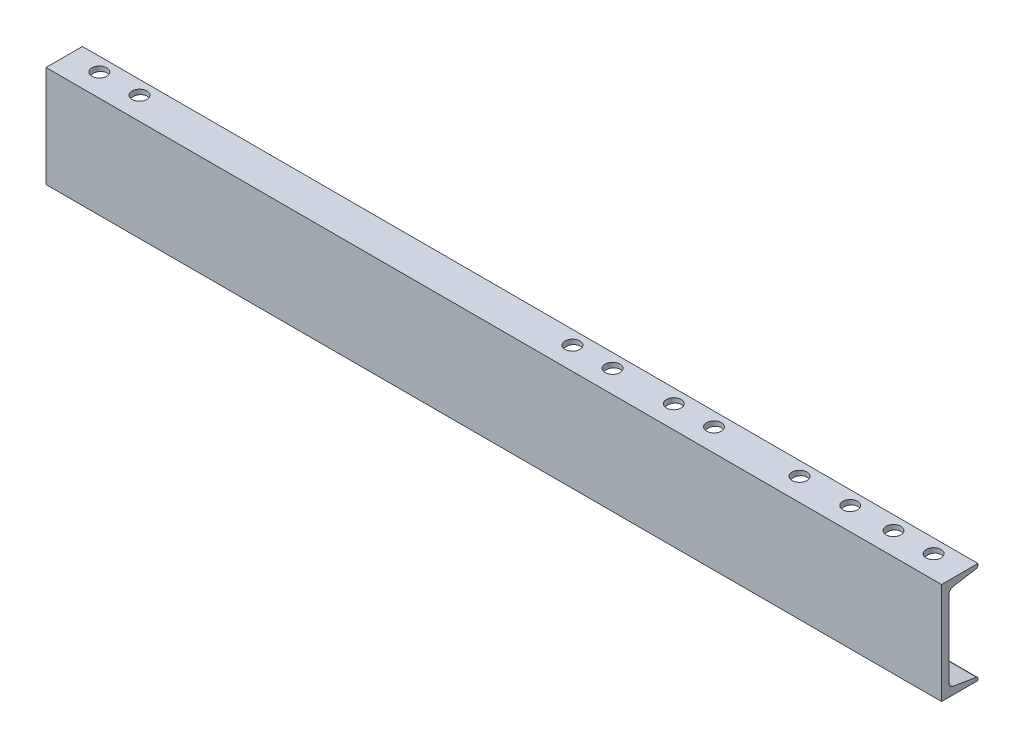
ISO-10303-21;
HEADER;
FILE_DESCRIPTION(('STEP AP214'),'2;1');
FILE_NAME('part.step','',(''),(''),'','','');
FILE_SCHEMA(('AUTOMOTIVE_DESIGN { 1 0 10303 214 1 1 1 1 }'));
ENDSEC;
DATA;
#1=APPLICATION_CONTEXT('core data for automotive mechanical design processes');
#2=APPLICATION_PROTOCOL_DEFINITION('international standard','automotive_design',2000,#1);
#3=PRODUCT_CONTEXT('',#1,'mechanical');
#4=PRODUCT('Part','Part','',(#3));
#5=PRODUCT_RELATED_PRODUCT_CATEGORY('part','',(#4));
#6=PRODUCT_DEFINITION_FORMATION('','',#4);
#7=PRODUCT_DEFINITION_CONTEXT('part definition',#1,'design');
#8=PRODUCT_DEFINITION('design','',#6,#7);
#9=PRODUCT_DEFINITION_SHAPE('','',#8);
#10=(LENGTH_UNIT() NAMED_UNIT(*) SI_UNIT(.MILLI.,.METRE.));
#11=(NAMED_UNIT(*) PLANE_ANGLE_UNIT() SI_UNIT($,.RADIAN.));
#12=(NAMED_UNIT(*) SI_UNIT($,.STERADIAN.) SOLID_ANGLE_UNIT());
#13=UNCERTAINTY_MEASURE_WITH_UNIT(LENGTH_MEASURE(1.E-05),#10,'distance_accuracy_value','');
#14=(GEOMETRIC_REPRESENTATION_CONTEXT(3) GLOBAL_UNCERTAINTY_ASSIGNED_CONTEXT((#13)) GLOBAL_UNIT_ASSIGNED_CONTEXT((#10,
#11,#12)) REPRESENTATION_CONTEXT('',''));
#15=CARTESIAN_POINT('',(0.,0.,0.));
#16=DIRECTION('',(0.,0.,1.));
#17=DIRECTION('',(1.,0.,0.));
#18=AXIS2_PLACEMENT_3D('',#15,#16,#17);
#19=CARTESIAN_POINT('',(673.1,-76.2,27.3939));
#20=DIRECTION('',(0.,1.,0.));
#21=DIRECTION('',(0.,0.,1.));
#22=AXIS2_PLACEMENT_3D('',#19,#20,#21);
#23=PLANE('',#22);
#24=CARTESIAN_POINT('',(425.45,-76.2,-6.73735));
#25=DIRECTION('',(0.,-1.,0.));
#26=DIRECTION('',(0.,0.,-1.));
#27=AXIS2_PLACEMENT_3D('',#24,#25,#26);
#28=CIRCLE('',#27,11.1125);
#29=CARTESIAN_POINT('',(425.45,-76.2,-17.84985));
#30=VERTEX_POINT('',#29);
#31=EDGE_CURVE('E250',#30,#30,#28,.T.);
#32=ORIENTED_EDGE('',*,*,#31,.F.);
#33=EDGE_LOOP('',(#32));
#34=FACE_BOUND('',#33,.T.);
#35=CARTESIAN_POINT('',(501.65,-76.2,-6.73735));
#36=DIRECTION('',(0.,-1.,0.));
#37=DIRECTION('',(0.,0.,-1.));
#38=AXIS2_PLACEMENT_3D('',#35,#36,#37);
#39=CIRCLE('',#38,11.1125);
#40=CARTESIAN_POINT('',(501.65,-76.2,-17.84985));
#41=VERTEX_POINT('',#40);
#42=EDGE_CURVE('E254',#41,#41,#39,.T.);
#43=ORIENTED_EDGE('',*,*,#42,.F.);
#44=EDGE_LOOP('',(#43));
#45=FACE_BOUND('',#44,.T.);
#46=CARTESIAN_POINT('',(-627.0625,-76.2,-6.73735));
#47=DIRECTION('',(0.,-1.,0.));
#48=DIRECTION('',(0.,0.,-1.));
#49=AXIS2_PLACEMENT_3D('',#46,#47,#48);
#50=CIRCLE('',#49,11.1125);
#51=CARTESIAN_POINT('',(-627.0625,-76.2,-17.84985));
#52=VERTEX_POINT('',#51);
#53=EDGE_CURVE('E258',#52,#52,#50,.T.);
#54=ORIENTED_EDGE('',*,*,#53,.F.);
#55=EDGE_LOOP('',(#54));
#56=FACE_BOUND('',#55,.T.);
#57=CARTESIAN_POINT('',(-566.7375,-76.2,-6.73735));
#58=DIRECTION('',(0.,-1.,0.));
#59=DIRECTION('',(0.,0.,-1.));
#60=AXIS2_PLACEMENT_3D('',#57,#58,#59);
#61=CIRCLE('',#60,11.1125);
#62=CARTESIAN_POINT('',(-566.7375,-76.2,-17.84985));
#63=VERTEX_POINT('',#62);
#64=EDGE_CURVE('E262',#63,#63,#61,.T.);
#65=ORIENTED_EDGE('',*,*,#64,.F.);
#66=EDGE_LOOP('',(#65));
#67=FACE_BOUND('',#66,.T.);
#68=CARTESIAN_POINT('',(84.1375,-76.2,-6.73735));
#69=DIRECTION('',(0.,-1.,0.));
#70=DIRECTION('',(0.,0.,-1.));
#71=AXIS2_PLACEMENT_3D('',#68,#69,#70);
#72=CIRCLE('',#71,11.1125);
#73=CARTESIAN_POINT('',(84.1375,-76.2,-17.84985));
#74=VERTEX_POINT('',#73);
#75=EDGE_CURVE('E266',#74,#74,#72,.T.);
#76=ORIENTED_EDGE('',*,*,#75,.F.);
#77=EDGE_LOOP('',(#76));
#78=FACE_BOUND('',#77,.T.);
#79=CARTESIAN_POINT('',(236.5375,-76.2,-6.73735));
#80=DIRECTION('',(0.,-1.,0.));
#81=DIRECTION('',(0.,0.,-1.));
#82=AXIS2_PLACEMENT_3D('',#79,#80,#81);
#83=CIRCLE('',#82,11.1125);
#84=CARTESIAN_POINT('',(236.5375,-76.2,-17.84985));
#85=VERTEX_POINT('',#84);
#86=EDGE_CURVE('E270',#85,#85,#83,.T.);
#87=ORIENTED_EDGE('',*,*,#86,.F.);
#88=EDGE_LOOP('',(#87));
#89=FACE_BOUND('',#88,.T.);
#90=CARTESIAN_POINT('',(296.8625,-76.2,-6.73735));
#91=DIRECTION('',(0.,-1.,0.));
#92=DIRECTION('',(0.,0.,-1.));
#93=AXIS2_PLACEMENT_3D('',#90,#91,#92);
#94=CIRCLE('',#93,11.1125);
#95=CARTESIAN_POINT('',(296.8625,-76.2,-17.84985));
#96=VERTEX_POINT('',#95);
#97=EDGE_CURVE('E274',#96,#96,#94,.T.);
#98=ORIENTED_EDGE('',*,*,#97,.F.);
#99=EDGE_LOOP('',(#98));
#100=FACE_BOUND('',#99,.T.);
#101=CARTESIAN_POINT('',(144.4625,-76.2,-6.73735));
#102=DIRECTION('',(0.,-1.,0.));
#103=DIRECTION('',(0.,0.,-1.));
#104=AXIS2_PLACEMENT_3D('',#101,#102,#103);
#105=CIRCLE('',#104,11.1125);
#106=CARTESIAN_POINT('',(144.4625,-76.2,-17.84985));
#107=VERTEX_POINT('',#106);
#108=EDGE_CURVE('E278',#107,#107,#105,.T.);
#109=ORIENTED_EDGE('',*,*,#108,.F.);
#110=EDGE_LOOP('',(#109));
#111=FACE_BOUND('',#110,.T.);
#112=CARTESIAN_POINT('',(566.7375,-76.2,-6.73735));
#113=DIRECTION('',(0.,-1.,0.));
#114=DIRECTION('',(0.,0.,-1.));
#115=AXIS2_PLACEMENT_3D('',#112,#113,#114);
#116=CIRCLE('',#115,11.1125);
#117=CARTESIAN_POINT('',(566.7375,-76.2,-17.84985));
#118=VERTEX_POINT('',#117);
#119=EDGE_CURVE('E282',#118,#118,#116,.T.);
#120=ORIENTED_EDGE('',*,*,#119,.F.);
#121=EDGE_LOOP('',(#120));
#122=FACE_BOUND('',#121,.T.);
#123=CARTESIAN_POINT('',(627.0625,-76.2,-6.73735));
#124=DIRECTION('',(0.,-1.,0.));
#125=DIRECTION('',(0.,0.,-1.));
#126=AXIS2_PLACEMENT_3D('',#123,#124,#125);
#127=CIRCLE('',#126,11.1125);
#128=CARTESIAN_POINT('',(627.0625,-76.2,-17.84985));
#129=VERTEX_POINT('',#128);
#130=EDGE_CURVE('E285',#129,#129,#127,.T.);
#131=ORIENTED_EDGE('',*,*,#130,.F.);
#132=EDGE_LOOP('',(#131));
#133=FACE_BOUND('',#132,.T.);
#134=DIRECTION('',(0.,0.,-1.));
#135=VECTOR('',#134,1.);
#136=CARTESIAN_POINT('',(-673.1,-76.2,27.3939));
#137=LINE('',#136,#135);
#138=CARTESIAN_POINT('',(-673.1,-76.2,27.3939));
#139=VERTEX_POINT('',#138);
#140=CARTESIAN_POINT('',(-673.1,-76.2,-27.3939));
#141=VERTEX_POINT('',#140);
#142=EDGE_CURVE('E137',#139,#141,#137,.T.);
#143=ORIENTED_EDGE('',*,*,#142,.T.);
#144=DIRECTION('',(-1.,0.,0.));
#145=VECTOR('',#144,1.);
#146=CARTESIAN_POINT('',(673.1,-76.2,-27.3939));
#147=LINE('',#146,#145);
#148=CARTESIAN_POINT('',(673.1,-76.2,-27.3939));
#149=VERTEX_POINT('',#148);
#150=EDGE_CURVE('E11',#149,#141,#147,.T.);
#151=ORIENTED_EDGE('',*,*,#150,.F.);
#152=DIRECTION('',(0.,0.,-1.));
#153=VECTOR('',#152,1.);
#154=CARTESIAN_POINT('',(673.1,-76.2,27.3939));
#155=LINE('',#154,#153);
#156=CARTESIAN_POINT('',(673.1,-76.2,27.3939));
#157=VERTEX_POINT('',#156);
#158=EDGE_CURVE('E160',#157,#149,#155,.T.);
#159=ORIENTED_EDGE('',*,*,#158,.F.);
#160=DIRECTION('',(-1.,0.,0.));
#161=VECTOR('',#160,1.);
#162=CARTESIAN_POINT('',(673.1,-76.2,27.3939));
#163=LINE('',#162,#161);
#164=EDGE_CURVE('E133',#157,#139,#163,.T.);
#165=ORIENTED_EDGE('',*,*,#164,.T.);
#166=EDGE_LOOP('',(#143,#151,#159,#165));
#167=FACE_BOUND('',#166,.T.);
#168=ADVANCED_FACE('F17',(#34,#45,#56,#67,#78,#89,#100,#111,#122,#133,#167),#23,.F.);
#169=CARTESIAN_POINT('',(673.1,-76.2,-27.3939));
#170=DIRECTION('',(0.,0.,1.));
#171=DIRECTION('',(1.,0.,0.));
#172=AXIS2_PLACEMENT_3D('',#169,#170,#171);
#173=PLANE('',#172);
#174=DIRECTION('',(0.,1.,0.));
#175=VECTOR('',#174,1.);
#176=CARTESIAN_POINT('',(-673.1,-76.2,-27.3939));
#177=LINE('',#176,#175);
#178=CARTESIAN_POINT('',(-673.1,-73.7107446530364,-27.3939));
#179=VERTEX_POINT('',#178);
#180=EDGE_CURVE('E140',#141,#179,#177,.T.);
#181=ORIENTED_EDGE('',*,*,#180,.T.);
#182=DIRECTION('',(-1.,0.,0.));
#183=VECTOR('',#182,1.);
#184=CARTESIAN_POINT('',(673.1,-73.7107446530364,-27.3939));
#185=LINE('',#184,#183);
#186=CARTESIAN_POINT('',(673.1,-73.7107446530364,-27.3939));
#187=VERTEX_POINT('',#186);
#188=EDGE_CURVE('E25',#187,#179,#185,.T.);
#189=ORIENTED_EDGE('',*,*,#188,.F.);
#190=DIRECTION('',(0.,1.,0.));
#191=VECTOR('',#190,1.);
#192=CARTESIAN_POINT('',(673.1,-76.2,-27.3939));
#193=LINE('',#192,#191);
#194=EDGE_CURVE('E88',#149,#187,#193,.T.);
#195=ORIENTED_EDGE('',*,*,#194,.F.);
#196=ORIENTED_EDGE('',*,*,#150,.T.);
#197=EDGE_LOOP('',(#181,#189,#195,#196));
#198=FACE_BOUND('',#197,.T.);
#199=ADVANCED_FACE('F241',(#198),#173,.F.);
#200=CARTESIAN_POINT('',(673.1,-73.7107446530364,-24.3459));
#201=DIRECTION('',(-1.,0.,0.));
#202=DIRECTION('',(0.,0.,1.));
#203=AXIS2_PLACEMENT_3D('',#200,#201,#202);
#204=CYLINDRICAL_SURFACE('',#203,3.048);
#205=CARTESIAN_POINT('',(-673.1,-73.7107446530364,-24.3459));
#206=DIRECTION('',(1.,0.,0.));
#207=DIRECTION('',(0.,0.,-1.));
#208=AXIS2_PLACEMENT_3D('',#205,#206,#207);
#209=CIRCLE('',#208,3.048);
#210=CARTESIAN_POINT('',(-673.1,-70.7042219011292,-24.8470236796088));
#211=VERTEX_POINT('',#210);
#212=EDGE_CURVE('E143',#179,#211,#209,.T.);
#213=ORIENTED_EDGE('',*,*,#212,.T.);
#214=DIRECTION('',(-1.,0.,0.));
#215=VECTOR('',#214,1.);
#216=CARTESIAN_POINT('',(673.1,-70.7042219011292,-24.8470236796088));
#217=LINE('',#216,#215);
#218=CARTESIAN_POINT('',(673.1,-70.7042219011292,-24.8470236796088));
#219=VERTEX_POINT('',#218);
#220=EDGE_CURVE('E179',#219,#211,#217,.T.);
#221=ORIENTED_EDGE('',*,*,#220,.F.);
#222=CARTESIAN_POINT('',(673.1,-73.7107446530364,-24.3459));
#223=DIRECTION('',(1.,0.,0.));
#224=DIRECTION('',(0.,0.,-1.));
#225=AXIS2_PLACEMENT_3D('',#222,#223,#224);
#226=CIRCLE('',#225,3.048);
#227=EDGE_CURVE('E187',#187,#219,#226,.T.);
#228=ORIENTED_EDGE('',*,*,#227,.F.);
#229=ORIENTED_EDGE('',*,*,#188,.T.);
#230=EDGE_LOOP('',(#213,#221,#228,#229));
#231=FACE_BOUND('',#230,.T.);
#232=ADVANCED_FACE('F185',(#231),#204,.T.);
#233=CARTESIAN_POINT('',(673.1,-64.908143628462,9.92690919902199));
#234=DIRECTION('',(0.,-0.986391978972162,0.164410656039631));
#235=DIRECTION('',(0.,-0.164410656039631,-0.986391978972162));
#236=AXIS2_PLACEMENT_3D('',#233,#234,#235);
#237=PLANE('',#236);
#238=CARTESIAN_POINT('',(425.45,-67.6857227711681,-6.73735));
#239=DIRECTION('',(0.,-0.986391978972162,0.164410656039631));
#240=DIRECTION('',(0.,-0.164410656039631,-0.986391978972162));
#241=AXIS2_PLACEMENT_3D('',#238,#239,#240);
#242=ELLIPSE('',#241,11.2658053156306,11.1125);
#243=CARTESIAN_POINT('',(425.45,-69.5379412139257,-17.84985));
#244=VERTEX_POINT('',#243);
#245=EDGE_CURVE('E516',#244,#244,#242,.T.);
#246=ORIENTED_EDGE('',*,*,#245,.T.);
#247=EDGE_LOOP('',(#246));
#248=FACE_BOUND('',#247,.T.);
#249=CARTESIAN_POINT('',(501.65,-67.6857227711681,-6.73735));
#250=DIRECTION('',(0.,-0.986391978972162,0.164410656039631));
#251=DIRECTION('',(0.,-0.164410656039631,-0.986391978972162));
#252=AXIS2_PLACEMENT_3D('',#249,#250,#251);
#253=ELLIPSE('',#252,11.2658053156306,11.1125);
#254=CARTESIAN_POINT('',(501.65,-69.5379412139257,-17.8498499999999));
#255=VERTEX_POINT('',#254);
#256=EDGE_CURVE('E532',#255,#255,#253,.T.);
#257=ORIENTED_EDGE('',*,*,#256,.T.);
#258=EDGE_LOOP('',(#257));
#259=FACE_BOUND('',#258,.T.);
#260=CARTESIAN_POINT('',(-627.0625,-67.6857227711681,-6.73735));
#261=DIRECTION('',(0.,-0.986391978972162,0.164410656039631));
#262=DIRECTION('',(0.,-0.164410656039631,-0.986391978972162));
#263=AXIS2_PLACEMENT_3D('',#260,#261,#262);
#264=ELLIPSE('',#263,11.2658053156306,11.1125);
#265=CARTESIAN_POINT('',(-627.0625,-69.5379412139257,-17.8498499999999));
#266=VERTEX_POINT('',#265);
#267=EDGE_CURVE('E542',#266,#266,#264,.T.);
#268=ORIENTED_EDGE('',*,*,#267,.T.);
#269=EDGE_LOOP('',(#268));
#270=FACE_BOUND('',#269,.T.);
#271=CARTESIAN_POINT('',(-566.7375,-67.6857227711681,-6.73735));
#272=DIRECTION('',(0.,-0.986391978972162,0.164410656039631));
#273=DIRECTION('',(0.,-0.164410656039631,-0.986391978972162));
#274=AXIS2_PLACEMENT_3D('',#271,#272,#273);
#275=ELLIPSE('',#274,11.2658053156306,11.1125);
#276=CARTESIAN_POINT('',(-566.7375,-69.5379412139257,-17.8498499999999));
#277=VERTEX_POINT('',#276);
#278=EDGE_CURVE('E552',#277,#277,#275,.T.);
#279=ORIENTED_EDGE('',*,*,#278,.T.);
#280=EDGE_LOOP('',(#279));
#281=FACE_BOUND('',#280,.T.);
#282=CARTESIAN_POINT('',(84.1375,-67.6857227711681,-6.73735));
#283=DIRECTION('',(0.,-0.986391978972162,0.164410656039631));
#284=DIRECTION('',(0.,-0.164410656039631,-0.986391978972162));
#285=AXIS2_PLACEMENT_3D('',#282,#283,#284);
#286=ELLIPSE('',#285,11.2658053156306,11.1125);
#287=CARTESIAN_POINT('',(84.1375,-69.5379412139257,-17.8498499999999));
#288=VERTEX_POINT('',#287);
#289=EDGE_CURVE('E562',#288,#288,#286,.T.);
#290=ORIENTED_EDGE('',*,*,#289,.T.);
#291=EDGE_LOOP('',(#290));
#292=FACE_BOUND('',#291,.T.);
#293=CARTESIAN_POINT('',(236.5375,-67.6857227711681,-6.73735));
#294=DIRECTION('',(0.,-0.986391978972162,0.164410656039631));
#295=DIRECTION('',(0.,-0.164410656039631,-0.986391978972162));
#296=AXIS2_PLACEMENT_3D('',#293,#294,#295);
#297=ELLIPSE('',#296,11.2658053156306,11.1125);
#298=CARTESIAN_POINT('',(236.5375,-69.5379412139257,-17.8498499999999));
#299=VERTEX_POINT('',#298);
#300=EDGE_CURVE('E572',#299,#299,#297,.T.);
#301=ORIENTED_EDGE('',*,*,#300,.T.);
#302=EDGE_LOOP('',(#301));
#303=FACE_BOUND('',#302,.T.);
#304=CARTESIAN_POINT('',(296.8625,-67.6857227711681,-6.73735));
#305=DIRECTION('',(0.,-0.986391978972162,0.164410656039631));
#306=DIRECTION('',(0.,-0.164410656039631,-0.986391978972162));
#307=AXIS2_PLACEMENT_3D('',#304,#305,#306);
#308=ELLIPSE('',#307,11.2658053156306,11.1125);
#309=CARTESIAN_POINT('',(296.8625,-69.5379412139257,-17.8498499999999));
#310=VERTEX_POINT('',#309);
#311=EDGE_CURVE('E582',#310,#310,#308,.T.);
#312=ORIENTED_EDGE('',*,*,#311,.T.);
#313=EDGE_LOOP('',(#312));
#314=FACE_BOUND('',#313,.T.);
#315=CARTESIAN_POINT('',(144.4625,-67.6857227711681,-6.73735));
#316=DIRECTION('',(0.,-0.986391978972162,0.164410656039631));
#317=DIRECTION('',(0.,-0.164410656039631,-0.986391978972162));
#318=AXIS2_PLACEMENT_3D('',#315,#316,#317);
#319=ELLIPSE('',#318,11.2658053156306,11.1125);
#320=CARTESIAN_POINT('',(144.4625,-69.5379412139257,-17.8498499999999));
#321=VERTEX_POINT('',#320);
#322=EDGE_CURVE('E592',#321,#321,#319,.T.);
#323=ORIENTED_EDGE('',*,*,#322,.T.);
#324=EDGE_LOOP('',(#323));
#325=FACE_BOUND('',#324,.T.);
#326=CARTESIAN_POINT('',(566.7375,-67.6857227711681,-6.73735));
#327=DIRECTION('',(0.,-0.986391978972162,0.164410656039631));
#328=DIRECTION('',(0.,-0.164410656039631,-0.986391978972162));
#329=AXIS2_PLACEMENT_3D('',#326,#327,#328);
#330=ELLIPSE('',#329,11.2658053156306,11.1125);
#331=CARTESIAN_POINT('',(566.7375,-69.5379412139257,-17.8498499999999));
#332=VERTEX_POINT('',#331);
#333=EDGE_CURVE('E288',#332,#332,#330,.T.);
#334=ORIENTED_EDGE('',*,*,#333,.T.);
#335=EDGE_LOOP('',(#334));
#336=FACE_BOUND('',#335,.T.);
#337=CARTESIAN_POINT('',(627.0625,-67.6857227711681,-6.73735));
#338=DIRECTION('',(0.,-0.986391978972162,0.164410656039631));
#339=DIRECTION('',(0.,-0.164410656039631,-0.986391978972162));
#340=AXIS2_PLACEMENT_3D('',#337,#338,#339);
#341=ELLIPSE('',#340,11.2658053156306,11.1125);
#342=CARTESIAN_POINT('',(627.0625,-69.5379412139257,-17.8498499999999));
#343=VERTEX_POINT('',#342);
#344=EDGE_CURVE('E141',#343,#343,#341,.T.);
#345=ORIENTED_EDGE('',*,*,#344,.T.);
#346=EDGE_LOOP('',(#345));
#347=FACE_BOUND('',#346,.T.);
#348=DIRECTION('',(0.,0.164410656039631,0.986391978972162));
#349=VECTOR('',#348,1.);
#350=CARTESIAN_POINT('',(-673.1,-64.908143628462,9.92690919902199));
#351=LINE('',#350,#349);
#352=CARTESIAN_POINT('',(-673.1,-64.908143628462,9.92690919902199));
#353=VERTEX_POINT('',#352);
#354=EDGE_CURVE('E145',#211,#353,#351,.T.);
#355=ORIENTED_EDGE('',*,*,#354,.T.);
#356=DIRECTION('',(-1.,0.,0.));
#357=VECTOR('',#356,1.);
#358=CARTESIAN_POINT('',(673.1,-64.908143628462,9.92690919902199));
#359=LINE('',#358,#357);
#360=CARTESIAN_POINT('',(673.1,-64.908143628462,9.92690919902199));
#361=VERTEX_POINT('',#360);
#362=EDGE_CURVE('E176',#361,#353,#359,.T.);
#363=ORIENTED_EDGE('',*,*,#362,.F.);
#364=DIRECTION('',(0.,0.164410656039631,0.986391978972162));
#365=VECTOR('',#364,1.);
#366=CARTESIAN_POINT('',(673.1,-64.908143628462,9.92690919902199));
#367=LINE('',#366,#365);
#368=EDGE_CURVE('E205',#219,#361,#367,.T.);
#369=ORIENTED_EDGE('',*,*,#368,.F.);
#370=ORIENTED_EDGE('',*,*,#220,.T.);
#371=EDGE_LOOP('',(#355,#363,#369,#370));
#372=FACE_BOUND('',#371,.T.);
#373=ADVANCED_FACE('F196',(#248,#259,#270,#281,#292,#303,#314,#325,#336,#347,#372),#237,.F.);
#374=CARTESIAN_POINT('',(673.1,-57.3918367486941,8.6741));
#375=DIRECTION('',(-1.,0.,0.));
#376=DIRECTION('',(0.,0.,1.));
#377=AXIS2_PLACEMENT_3D('',#374,#375,#376);
#378=CYLINDRICAL_SURFACE('',#377,7.62);
#379=CARTESIAN_POINT('',(-673.1,-57.3918367486941,8.6741));
#380=DIRECTION('',(-1.,0.,0.));
#381=DIRECTION('',(0.,0.,-1.));
#382=AXIS2_PLACEMENT_3D('',#379,#380,#381);
#383=CIRCLE('',#382,7.62);
#384=CARTESIAN_POINT('',(-673.1,-57.3918367486941,16.2941));
#385=VERTEX_POINT('',#384);
#386=EDGE_CURVE('E147',#353,#385,#383,.T.);
#387=ORIENTED_EDGE('',*,*,#386,.T.);
#388=DIRECTION('',(-1.,0.,0.));
#389=VECTOR('',#388,1.);
#390=CARTESIAN_POINT('',(673.1,-57.3918367486941,16.2941));
#391=LINE('',#390,#389);
#392=CARTESIAN_POINT('',(673.1,-57.3918367486941,16.2941));
#393=VERTEX_POINT('',#392);
#394=EDGE_CURVE('E173',#393,#385,#391,.T.);
#395=ORIENTED_EDGE('',*,*,#394,.F.);
#396=CARTESIAN_POINT('',(673.1,-57.3918367486941,8.6741));
#397=DIRECTION('',(-1.,0.,0.));
#398=DIRECTION('',(0.,0.,-1.));
#399=AXIS2_PLACEMENT_3D('',#396,#397,#398);
#400=CIRCLE('',#399,7.62);
#401=EDGE_CURVE('E202',#361,#393,#400,.T.);
#402=ORIENTED_EDGE('',*,*,#401,.F.);
#403=ORIENTED_EDGE('',*,*,#362,.T.);
#404=EDGE_LOOP('',(#387,#395,#402,#403));
#405=FACE_BOUND('',#404,.T.);
#406=ADVANCED_FACE('F200',(#405),#378,.F.);
#407=CARTESIAN_POINT('',(673.1,57.3918367486941,16.2941));
#408=DIRECTION('',(0.,0.,1.));
#409=DIRECTION('',(0.,-1.,0.));
#410=AXIS2_PLACEMENT_3D('',#407,#408,#409);
#411=PLANE('',#410);
#412=DIRECTION('',(0.,1.,0.));
#413=VECTOR('',#412,1.);
#414=CARTESIAN_POINT('',(-673.1,57.3918367486941,16.2941));
#415=LINE('',#414,#413);
#416=CARTESIAN_POINT('',(-673.1,57.3918367486941,16.2941));
#417=VERTEX_POINT('',#416);
#418=EDGE_CURVE('E149',#385,#417,#415,.T.);
#419=ORIENTED_EDGE('',*,*,#418,.T.);
#420=DIRECTION('',(-1.,0.,0.));
#421=VECTOR('',#420,1.);
#422=CARTESIAN_POINT('',(673.1,57.3918367486941,16.2941));
#423=LINE('',#422,#421);
#424=CARTESIAN_POINT('',(673.1,57.3918367486941,16.2941));
#425=VERTEX_POINT('',#424);
#426=EDGE_CURVE('E170',#425,#417,#423,.T.);
#427=ORIENTED_EDGE('',*,*,#426,.F.);
#428=DIRECTION('',(0.,1.,0.));
#429=VECTOR('',#428,1.);
#430=CARTESIAN_POINT('',(673.1,57.3918367486941,16.2941));
#431=LINE('',#430,#429);
#432=EDGE_CURVE('E204',#393,#425,#431,.T.);
#433=ORIENTED_EDGE('',*,*,#432,.F.);
#434=ORIENTED_EDGE('',*,*,#394,.T.);
#435=EDGE_LOOP('',(#419,#427,#433,#434));
#436=FACE_BOUND('',#435,.T.);
#437=ADVANCED_FACE('F615',(#436),#411,.F.);
#438=CARTESIAN_POINT('',(673.1,57.3918367486941,8.6741));
#439=DIRECTION('',(-1.,0.,0.));
#440=DIRECTION('',(0.,0.,1.));
#441=AXIS2_PLACEMENT_3D('',#438,#439,#440);
#442=CYLINDRICAL_SURFACE('',#441,7.62);
#443=CARTESIAN_POINT('',(-673.1,57.3918367486941,8.6741));
#444=DIRECTION('',(-1.,0.,0.));
#445=DIRECTION('',(0.,0.,1.));
#446=AXIS2_PLACEMENT_3D('',#443,#444,#445);
#447=CIRCLE('',#446,7.62);
#448=CARTESIAN_POINT('',(-673.1,64.908143628462,9.92690919902198));
#449=VERTEX_POINT('',#448);
#450=EDGE_CURVE('E151',#417,#449,#447,.T.);
#451=ORIENTED_EDGE('',*,*,#450,.T.);
#452=DIRECTION('',(-1.,0.,0.));
#453=VECTOR('',#452,1.);
#454=CARTESIAN_POINT('',(673.1,64.908143628462,9.92690919902198));
#455=LINE('',#454,#453);
#456=CARTESIAN_POINT('',(673.1,64.908143628462,9.92690919902198));
#457=VERTEX_POINT('',#456);
#458=EDGE_CURVE('E167',#457,#449,#455,.T.);
#459=ORIENTED_EDGE('',*,*,#458,.F.);
#460=CARTESIAN_POINT('',(673.1,57.3918367486941,8.6741));
#461=DIRECTION('',(-1.,0.,0.));
#462=DIRECTION('',(0.,0.,1.));
#463=AXIS2_PLACEMENT_3D('',#460,#461,#462);
#464=CIRCLE('',#463,7.62);
#465=EDGE_CURVE('E207',#425,#457,#464,.T.);
#466=ORIENTED_EDGE('',*,*,#465,.F.);
#467=ORIENTED_EDGE('',*,*,#426,.T.);
#468=EDGE_LOOP('',(#451,#459,#466,#467));
#469=FACE_BOUND('',#468,.T.);
#470=ADVANCED_FACE('F604',(#469),#442,.F.);
#471=CARTESIAN_POINT('',(673.1,64.908143628462,9.92690919902198));
#472=DIRECTION('',(0.,0.986391978972162,0.16441065603963));
#473=DIRECTION('',(0.,-0.16441065603963,0.986391978972162));
#474=AXIS2_PLACEMENT_3D('',#471,#472,#473);
#475=PLANE('',#474);
#476=CARTESIAN_POINT('',(425.45,67.6857227711681,-6.73735));
#477=DIRECTION('',(0.,0.986391978972162,0.16441065603963));
#478=DIRECTION('',(0.,-0.16441065603963,0.986391978972162));
#479=AXIS2_PLACEMENT_3D('',#476,#477,#478);
#480=ELLIPSE('',#479,11.2658053156306,11.1125);
#481=CARTESIAN_POINT('',(425.45,65.8335043284105,4.37515000000001));
#482=VERTEX_POINT('',#481);
#483=EDGE_CURVE('E518',#482,#482,#480,.T.);
#484=ORIENTED_EDGE('',*,*,#483,.T.);
#485=EDGE_LOOP('',(#484));
#486=FACE_BOUND('',#485,.T.);
#487=CARTESIAN_POINT('',(501.65,67.6857227711681,-6.73735));
#488=DIRECTION('',(0.,0.986391978972162,0.16441065603963));
#489=DIRECTION('',(0.,-0.16441065603963,0.986391978972162));
#490=AXIS2_PLACEMENT_3D('',#487,#488,#489);
#491=ELLIPSE('',#490,11.2658053156306,11.1125);
#492=CARTESIAN_POINT('',(501.65,65.8335043284105,4.37514999999995));
#493=VERTEX_POINT('',#492);
#494=EDGE_CURVE('E529',#493,#493,#491,.T.);
#495=ORIENTED_EDGE('',*,*,#494,.T.);
#496=EDGE_LOOP('',(#495));
#497=FACE_BOUND('',#496,.T.);
#498=CARTESIAN_POINT('',(-627.0625,67.6857227711681,-6.73735));
#499=DIRECTION('',(0.,0.986391978972162,0.16441065603963));
#500=DIRECTION('',(0.,-0.16441065603963,0.986391978972162));
#501=AXIS2_PLACEMENT_3D('',#498,#499,#500);
#502=ELLIPSE('',#501,11.2658053156306,11.1125);
#503=CARTESIAN_POINT('',(-627.0625,65.8335043284105,4.37514999999995));
#504=VERTEX_POINT('',#503);
#505=EDGE_CURVE('E539',#504,#504,#502,.T.);
#506=ORIENTED_EDGE('',*,*,#505,.T.);
#507=EDGE_LOOP('',(#506));
#508=FACE_BOUND('',#507,.T.);
#509=CARTESIAN_POINT('',(-566.7375,67.6857227711681,-6.73735));
#510=DIRECTION('',(0.,0.986391978972162,0.16441065603963));
#511=DIRECTION('',(0.,-0.16441065603963,0.986391978972162));
#512=AXIS2_PLACEMENT_3D('',#509,#510,#511);
#513=ELLIPSE('',#512,11.2658053156306,11.1125);
#514=CARTESIAN_POINT('',(-566.7375,65.8335043284105,4.37514999999995));
#515=VERTEX_POINT('',#514);
#516=EDGE_CURVE('E549',#515,#515,#513,.T.);
#517=ORIENTED_EDGE('',*,*,#516,.T.);
#518=EDGE_LOOP('',(#517));
#519=FACE_BOUND('',#518,.T.);
#520=CARTESIAN_POINT('',(84.1375,67.6857227711681,-6.73735));
#521=DIRECTION('',(0.,0.986391978972162,0.16441065603963));
#522=DIRECTION('',(0.,-0.16441065603963,0.986391978972162));
#523=AXIS2_PLACEMENT_3D('',#520,#521,#522);
#524=ELLIPSE('',#523,11.2658053156306,11.1125);
#525=CARTESIAN_POINT('',(84.1375,65.8335043284105,4.37514999999995));
#526=VERTEX_POINT('',#525);
#527=EDGE_CURVE('E559',#526,#526,#524,.T.);
#528=ORIENTED_EDGE('',*,*,#527,.T.);
#529=EDGE_LOOP('',(#528));
#530=FACE_BOUND('',#529,.T.);
#531=CARTESIAN_POINT('',(236.5375,67.6857227711681,-6.73735));
#532=DIRECTION('',(0.,0.986391978972162,0.16441065603963));
#533=DIRECTION('',(0.,-0.16441065603963,0.986391978972162));
#534=AXIS2_PLACEMENT_3D('',#531,#532,#533);
#535=ELLIPSE('',#534,11.2658053156306,11.1125);
#536=CARTESIAN_POINT('',(236.5375,65.8335043284105,4.37514999999995));
#537=VERTEX_POINT('',#536);
#538=EDGE_CURVE('E569',#537,#537,#535,.T.);
#539=ORIENTED_EDGE('',*,*,#538,.T.);
#540=EDGE_LOOP('',(#539));
#541=FACE_BOUND('',#540,.T.);
#542=CARTESIAN_POINT('',(296.8625,67.6857227711681,-6.73735));
#543=DIRECTION('',(0.,0.986391978972162,0.16441065603963));
#544=DIRECTION('',(0.,-0.16441065603963,0.986391978972162));
#545=AXIS2_PLACEMENT_3D('',#542,#543,#544);
#546=ELLIPSE('',#545,11.2658053156306,11.1125);
#547=CARTESIAN_POINT('',(296.8625,65.8335043284105,4.37514999999995));
#548=VERTEX_POINT('',#547);
#549=EDGE_CURVE('E579',#548,#548,#546,.T.);
#550=ORIENTED_EDGE('',*,*,#549,.T.);
#551=EDGE_LOOP('',(#550));
#552=FACE_BOUND('',#551,.T.);
#553=CARTESIAN_POINT('',(144.4625,67.6857227711681,-6.73735));
#554=DIRECTION('',(0.,0.986391978972162,0.16441065603963));
#555=DIRECTION('',(0.,-0.16441065603963,0.986391978972162));
#556=AXIS2_PLACEMENT_3D('',#553,#554,#555);
#557=ELLIPSE('',#556,11.2658053156306,11.1125);
#558=CARTESIAN_POINT('',(144.4625,65.8335043284105,4.37514999999995));
#559=VERTEX_POINT('',#558);
#560=EDGE_CURVE('E589',#559,#559,#557,.T.);
#561=ORIENTED_EDGE('',*,*,#560,.T.);
#562=EDGE_LOOP('',(#561));
#563=FACE_BOUND('',#562,.T.);
#564=CARTESIAN_POINT('',(566.7375,67.6857227711681,-6.73735));
#565=DIRECTION('',(0.,0.986391978972162,0.16441065603963));
#566=DIRECTION('',(0.,-0.16441065603963,0.986391978972162));
#567=AXIS2_PLACEMENT_3D('',#564,#565,#566);
#568=ELLIPSE('',#567,11.2658053156306,11.1125);
#569=CARTESIAN_POINT('',(566.7375,65.8335043284105,4.37514999999995));
#570=VERTEX_POINT('',#569);
#571=EDGE_CURVE('E294',#570,#570,#568,.T.);
#572=ORIENTED_EDGE('',*,*,#571,.T.);
#573=EDGE_LOOP('',(#572));
#574=FACE_BOUND('',#573,.T.);
#575=CARTESIAN_POINT('',(627.0625,67.6857227711681,-6.73735));
#576=DIRECTION('',(0.,0.986391978972162,0.16441065603963));
#577=DIRECTION('',(0.,-0.16441065603963,0.986391978972162));
#578=AXIS2_PLACEMENT_3D('',#575,#576,#577);
#579=ELLIPSE('',#578,11.2658053156306,11.1125);
#580=CARTESIAN_POINT('',(627.0625,65.8335043284105,4.37514999999995));
#581=VERTEX_POINT('',#580);
#582=EDGE_CURVE('E291',#581,#581,#579,.T.);
#583=ORIENTED_EDGE('',*,*,#582,.T.);
#584=EDGE_LOOP('',(#583));
#585=FACE_BOUND('',#584,.T.);
#586=DIRECTION('',(0.,0.16441065603963,-0.986391978972162));
#587=VECTOR('',#586,1.);
#588=CARTESIAN_POINT('',(-673.1,64.908143628462,9.92690919902198));
#589=LINE('',#588,#587);
#590=CARTESIAN_POINT('',(-673.1,70.7042219011292,-24.8470236796088));
#591=VERTEX_POINT('',#590);
#592=EDGE_CURVE('E153',#449,#591,#589,.T.);
#593=ORIENTED_EDGE('',*,*,#592,.T.);
#594=DIRECTION('',(-1.,0.,0.));
#595=VECTOR('',#594,1.);
#596=CARTESIAN_POINT('',(673.1,70.7042219011292,-24.8470236796088));
#597=LINE('',#596,#595);
#598=CARTESIAN_POINT('',(673.1,70.7042219011292,-24.8470236796088));
#599=VERTEX_POINT('',#598);
#600=EDGE_CURVE('E164',#599,#591,#597,.T.);
#601=ORIENTED_EDGE('',*,*,#600,.F.);
#602=DIRECTION('',(0.,0.16441065603963,-0.986391978972162));
#603=VECTOR('',#602,1.);
#604=CARTESIAN_POINT('',(673.1,64.908143628462,9.92690919902198));
#605=LINE('',#604,#603);
#606=EDGE_CURVE('E213',#457,#599,#605,.T.);
#607=ORIENTED_EDGE('',*,*,#606,.F.);
#608=ORIENTED_EDGE('',*,*,#458,.T.);
#609=EDGE_LOOP('',(#593,#601,#607,#608));
#610=FACE_BOUND('',#609,.T.);
#611=ADVANCED_FACE('F219',(#486,#497,#508,#519,#530,#541,#552,#563,#574,#585,#610),#475,.F.);
#612=CARTESIAN_POINT('',(673.1,73.7107446530364,-24.3459));
#613=DIRECTION('',(-1.,0.,0.));
#614=DIRECTION('',(0.,0.,1.));
#615=AXIS2_PLACEMENT_3D('',#612,#613,#614);
#616=CYLINDRICAL_SURFACE('',#615,3.048);
#617=CARTESIAN_POINT('',(-673.1,73.7107446530364,-24.3459));
#618=DIRECTION('',(1.,0.,0.));
#619=DIRECTION('',(0.,0.,1.));
#620=AXIS2_PLACEMENT_3D('',#617,#618,#619);
#621=CIRCLE('',#620,3.048);
#622=CARTESIAN_POINT('',(-673.1,73.7107446530364,-27.3939));
#623=VERTEX_POINT('',#622);
#624=EDGE_CURVE('E155',#591,#623,#621,.T.);
#625=ORIENTED_EDGE('',*,*,#624,.T.);
#626=DIRECTION('',(-1.,0.,0.));
#627=VECTOR('',#626,1.);
#628=CARTESIAN_POINT('',(673.1,73.7107446530364,-27.3939));
#629=LINE('',#628,#627);
#630=CARTESIAN_POINT('',(673.1,73.7107446530364,-27.3939));
#631=VERTEX_POINT('',#630);
#632=EDGE_CURVE('E128',#631,#623,#629,.T.);
#633=ORIENTED_EDGE('',*,*,#632,.F.);
#634=CARTESIAN_POINT('',(673.1,73.7107446530364,-24.3459));
#635=DIRECTION('',(1.,0.,0.));
#636=DIRECTION('',(0.,0.,1.));
#637=AXIS2_PLACEMENT_3D('',#634,#635,#636);
#638=CIRCLE('',#637,3.048);
#639=EDGE_CURVE('E119',#599,#631,#638,.T.);
#640=ORIENTED_EDGE('',*,*,#639,.F.);
#641=ORIENTED_EDGE('',*,*,#600,.T.);
#642=EDGE_LOOP('',(#625,#633,#640,#641));
#643=FACE_BOUND('',#642,.T.);
#644=ADVANCED_FACE('F223',(#643),#616,.T.);
#645=CARTESIAN_POINT('',(673.1,76.2,-27.3939));
#646=DIRECTION('',(0.,0.,1.));
#647=DIRECTION('',(0.,-1.,0.));
#648=AXIS2_PLACEMENT_3D('',#645,#646,#647);
#649=PLANE('',#648);
#650=DIRECTION('',(0.,1.,0.));
#651=VECTOR('',#650,1.);
#652=CARTESIAN_POINT('',(-673.1,76.2,-27.3939));
#653=LINE('',#652,#651);
#654=CARTESIAN_POINT('',(-673.1,76.2,-27.3939));
#655=VERTEX_POINT('',#654);
#656=EDGE_CURVE('E127',#623,#655,#653,.T.);
#657=ORIENTED_EDGE('',*,*,#656,.T.);
#658=DIRECTION('',(-1.,0.,0.));
#659=VECTOR('',#658,1.);
#660=CARTESIAN_POINT('',(673.1,76.2,-27.3939));
#661=LINE('',#660,#659);
#662=CARTESIAN_POINT('',(673.1,76.2,-27.3939));
#663=VERTEX_POINT('',#662);
#664=EDGE_CURVE('E124',#663,#655,#661,.T.);
#665=ORIENTED_EDGE('',*,*,#664,.F.);
#666=DIRECTION('',(0.,1.,0.));
#667=VECTOR('',#666,1.);
#668=CARTESIAN_POINT('',(673.1,76.2,-27.3939));
#669=LINE('',#668,#667);
#670=EDGE_CURVE('E113',#631,#663,#669,.T.);
#671=ORIENTED_EDGE('',*,*,#670,.F.);
#672=ORIENTED_EDGE('',*,*,#632,.T.);
#673=EDGE_LOOP('',(#657,#665,#671,#672));
#674=FACE_BOUND('',#673,.T.);
#675=ADVANCED_FACE('F125',(#674),#649,.F.);
#676=CARTESIAN_POINT('',(673.1,76.2,27.3939));
#677=DIRECTION('',(0.,-1.,0.));
#678=DIRECTION('',(0.,0.,-1.));
#679=AXIS2_PLACEMENT_3D('',#676,#677,#678);
#680=PLANE('',#679);
#681=CARTESIAN_POINT('',(425.45,76.2,-6.73735));
#682=DIRECTION('',(0.,-1.,0.));
#683=DIRECTION('',(0.,0.,-1.));
#684=AXIS2_PLACEMENT_3D('',#681,#682,#683);
#685=CIRCLE('',#684,11.1125);
#686=CARTESIAN_POINT('',(425.45,76.2,-17.84985));
#687=VERTEX_POINT('',#686);
#688=EDGE_CURVE('E523',#687,#687,#685,.F.);
#689=ORIENTED_EDGE('',*,*,#688,.F.);
#690=EDGE_LOOP('',(#689));
#691=FACE_BOUND('',#690,.T.);
#692=CARTESIAN_POINT('',(501.65,76.2,-6.73735));
#693=DIRECTION('',(0.,-1.,0.));
#694=DIRECTION('',(0.,0.,-1.));
#695=AXIS2_PLACEMENT_3D('',#692,#693,#694);
#696=CIRCLE('',#695,11.1125);
#697=CARTESIAN_POINT('',(501.65,76.2,-17.84985));
#698=VERTEX_POINT('',#697);
#699=EDGE_CURVE('E520',#698,#698,#696,.F.);
#700=ORIENTED_EDGE('',*,*,#699,.F.);
#701=EDGE_LOOP('',(#700));
#702=FACE_BOUND('',#701,.T.);
#703=CARTESIAN_POINT('',(-627.0625,76.2,-6.73735));
#704=DIRECTION('',(0.,-1.,0.));
#705=DIRECTION('',(0.,0.,-1.));
#706=AXIS2_PLACEMENT_3D('',#703,#704,#705);
#707=CIRCLE('',#706,11.1125);
#708=CARTESIAN_POINT('',(-627.0625,76.2,-17.84985));
#709=VERTEX_POINT('',#708);
#710=EDGE_CURVE('E536',#709,#709,#707,.F.);
#711=ORIENTED_EDGE('',*,*,#710,.F.);
#712=EDGE_LOOP('',(#711));
#713=FACE_BOUND('',#712,.T.);
#714=CARTESIAN_POINT('',(-566.7375,76.2,-6.73735));
#715=DIRECTION('',(0.,-1.,0.));
#716=DIRECTION('',(0.,0.,-1.));
#717=AXIS2_PLACEMENT_3D('',#714,#715,#716);
#718=CIRCLE('',#717,11.1125);
#719=CARTESIAN_POINT('',(-566.7375,76.2,-17.84985));
#720=VERTEX_POINT('',#719);
#721=EDGE_CURVE('E546',#720,#720,#718,.F.);
#722=ORIENTED_EDGE('',*,*,#721,.F.);
#723=EDGE_LOOP('',(#722));
#724=FACE_BOUND('',#723,.T.);
#725=CARTESIAN_POINT('',(84.1375,76.2,-6.73735));
#726=DIRECTION('',(0.,-1.,0.));
#727=DIRECTION('',(0.,0.,-1.));
#728=AXIS2_PLACEMENT_3D('',#725,#726,#727);
#729=CIRCLE('',#728,11.1125);
#730=CARTESIAN_POINT('',(84.1375,76.2,-17.84985));
#731=VERTEX_POINT('',#730);
#732=EDGE_CURVE('E556',#731,#731,#729,.F.);
#733=ORIENTED_EDGE('',*,*,#732,.F.);
#734=EDGE_LOOP('',(#733));
#735=FACE_BOUND('',#734,.T.);
#736=CARTESIAN_POINT('',(236.5375,76.2,-6.73735));
#737=DIRECTION('',(0.,-1.,0.));
#738=DIRECTION('',(0.,0.,-1.));
#739=AXIS2_PLACEMENT_3D('',#736,#737,#738);
#740=CIRCLE('',#739,11.1125);
#741=CARTESIAN_POINT('',(236.5375,76.2,-17.84985));
#742=VERTEX_POINT('',#741);
#743=EDGE_CURVE('E566',#742,#742,#740,.F.);
#744=ORIENTED_EDGE('',*,*,#743,.F.);
#745=EDGE_LOOP('',(#744));
#746=FACE_BOUND('',#745,.T.);
#747=CARTESIAN_POINT('',(296.8625,76.2,-6.73735));
#748=DIRECTION('',(0.,-1.,0.));
#749=DIRECTION('',(0.,0.,-1.));
#750=AXIS2_PLACEMENT_3D('',#747,#748,#749);
#751=CIRCLE('',#750,11.1125);
#752=CARTESIAN_POINT('',(296.8625,76.2,-17.84985));
#753=VERTEX_POINT('',#752);
#754=EDGE_CURVE('E576',#753,#753,#751,.F.);
#755=ORIENTED_EDGE('',*,*,#754,.F.);
#756=EDGE_LOOP('',(#755));
#757=FACE_BOUND('',#756,.T.);
#758=CARTESIAN_POINT('',(144.4625,76.2,-6.73735));
#759=DIRECTION('',(0.,-1.,0.));
#760=DIRECTION('',(0.,0.,-1.));
#761=AXIS2_PLACEMENT_3D('',#758,#759,#760);
#762=CIRCLE('',#761,11.1125);
#763=CARTESIAN_POINT('',(144.4625,76.2,-17.84985));
#764=VERTEX_POINT('',#763);
#765=EDGE_CURVE('E586',#764,#764,#762,.F.);
#766=ORIENTED_EDGE('',*,*,#765,.F.);
#767=EDGE_LOOP('',(#766));
#768=FACE_BOUND('',#767,.T.);
#769=CARTESIAN_POINT('',(566.7375,76.2,-6.73735));
#770=DIRECTION('',(0.,-1.,0.));
#771=DIRECTION('',(0.,0.,-1.));
#772=AXIS2_PLACEMENT_3D('',#769,#770,#771);
#773=CIRCLE('',#772,11.1125);
#774=CARTESIAN_POINT('',(566.7375,76.2,-17.84985));
#775=VERTEX_POINT('',#774);
#776=EDGE_CURVE('E596',#775,#775,#773,.F.);
#777=ORIENTED_EDGE('',*,*,#776,.F.);
#778=EDGE_LOOP('',(#777));
#779=FACE_BOUND('',#778,.T.);
#780=CARTESIAN_POINT('',(627.0625,76.2,-6.73735));
#781=DIRECTION('',(0.,-1.,0.));
#782=DIRECTION('',(0.,0.,-1.));
#783=AXIS2_PLACEMENT_3D('',#780,#781,#782);
#784=CIRCLE('',#783,11.1125);
#785=CARTESIAN_POINT('',(627.0625,76.2,-17.84985));
#786=VERTEX_POINT('',#785);
#787=EDGE_CURVE('E287',#786,#786,#784,.F.);
#788=ORIENTED_EDGE('',*,*,#787,.F.);
#789=EDGE_LOOP('',(#788));
#790=FACE_BOUND('',#789,.T.);
#791=DIRECTION('',(0.,0.,1.));
#792=VECTOR('',#791,1.);
#793=CARTESIAN_POINT('',(-673.1,76.2,27.3939));
#794=LINE('',#793,#792);
#795=CARTESIAN_POINT('',(-673.1,76.2,27.3939));
#796=VERTEX_POINT('',#795);
#797=EDGE_CURVE('E74',#655,#796,#794,.T.);
#798=ORIENTED_EDGE('',*,*,#797,.T.);
#799=DIRECTION('',(-1.,0.,0.));
#800=VECTOR('',#799,1.);
#801=CARTESIAN_POINT('',(673.1,76.2,27.3939));
#802=LINE('',#801,#800);
#803=CARTESIAN_POINT('',(673.1,76.2,27.3939));
#804=VERTEX_POINT('',#803);
#805=EDGE_CURVE('E129',#804,#796,#802,.T.);
#806=ORIENTED_EDGE('',*,*,#805,.F.);
#807=DIRECTION('',(0.,0.,1.));
#808=VECTOR('',#807,1.);
#809=CARTESIAN_POINT('',(673.1,76.2,27.3939));
#810=LINE('',#809,#808);
#811=EDGE_CURVE('E117',#663,#804,#810,.T.);
#812=ORIENTED_EDGE('',*,*,#811,.F.);
#813=ORIENTED_EDGE('',*,*,#664,.T.);
#814=EDGE_LOOP('',(#798,#806,#812,#813));
#815=FACE_BOUND('',#814,.T.);
#816=ADVANCED_FACE('F131',(#691,#702,#713,#724,#735,#746,#757,#768,#779,#790,#815),#680,.F.);
#817=CARTESIAN_POINT('',(673.1,-76.2,27.3939));
#818=DIRECTION('',(0.,0.,-1.));
#819=DIRECTION('',(-1.,0.,0.));
#820=AXIS2_PLACEMENT_3D('',#817,#818,#819);
#821=PLANE('',#820);
#822=DIRECTION('',(0.,-1.,0.));
#823=VECTOR('',#822,1.);
#824=CARTESIAN_POINT('',(-673.1,-76.2,27.3939));
#825=LINE('',#824,#823);
#826=EDGE_CURVE('E80',#796,#139,#825,.T.);
#827=ORIENTED_EDGE('',*,*,#826,.T.);
#828=ORIENTED_EDGE('',*,*,#164,.F.);
#829=DIRECTION('',(0.,-1.,0.));
#830=VECTOR('',#829,1.);
#831=CARTESIAN_POINT('',(673.1,-76.2,27.3939));
#832=LINE('',#831,#830);
#833=EDGE_CURVE('E33',#804,#157,#832,.T.);
#834=ORIENTED_EDGE('',*,*,#833,.F.);
#835=ORIENTED_EDGE('',*,*,#805,.T.);
#836=EDGE_LOOP('',(#827,#828,#834,#835));
#837=FACE_BOUND('',#836,.T.);
#838=ADVANCED_FACE('F227',(#837),#821,.F.);
#839=CARTESIAN_POINT('',(673.1,-73.7107446530364,-24.3459));
#840=DIRECTION('',(1.,0.,0.));
#841=DIRECTION('',(0.,0.,-1.));
#842=AXIS2_PLACEMENT_3D('',#839,#840,#841);
#843=PLANE('',#842);
#844=ORIENTED_EDGE('',*,*,#158,.T.);
#845=ORIENTED_EDGE('',*,*,#194,.T.);
#846=ORIENTED_EDGE('',*,*,#227,.T.);
#847=ORIENTED_EDGE('',*,*,#368,.T.);
#848=ORIENTED_EDGE('',*,*,#401,.T.);
#849=ORIENTED_EDGE('',*,*,#432,.T.);
#850=ORIENTED_EDGE('',*,*,#465,.T.);
#851=ORIENTED_EDGE('',*,*,#606,.T.);
#852=ORIENTED_EDGE('',*,*,#639,.T.);
#853=ORIENTED_EDGE('',*,*,#670,.T.);
#854=ORIENTED_EDGE('',*,*,#811,.T.);
#855=ORIENTED_EDGE('',*,*,#833,.T.);
#856=EDGE_LOOP('',(#844,#845,#846,#847,#848,#849,#850,#851,#852,#853,#854,#855));
#857=FACE_BOUND('',#856,.T.);
#858=ADVANCED_FACE('F115',(#857),#843,.T.);
#859=CARTESIAN_POINT('',(-673.1,-73.7107446530364,-24.3459));
#860=DIRECTION('',(1.,0.,0.));
#861=DIRECTION('',(0.,0.,-1.));
#862=AXIS2_PLACEMENT_3D('',#859,#860,#861);
#863=PLANE('',#862);
#864=ORIENTED_EDGE('',*,*,#142,.F.);
#865=ORIENTED_EDGE('',*,*,#826,.F.);
#866=ORIENTED_EDGE('',*,*,#797,.F.);
#867=ORIENTED_EDGE('',*,*,#656,.F.);
#868=ORIENTED_EDGE('',*,*,#624,.F.);
#869=ORIENTED_EDGE('',*,*,#592,.F.);
#870=ORIENTED_EDGE('',*,*,#450,.F.);
#871=ORIENTED_EDGE('',*,*,#418,.F.);
#872=ORIENTED_EDGE('',*,*,#386,.F.);
#873=ORIENTED_EDGE('',*,*,#354,.F.);
#874=ORIENTED_EDGE('',*,*,#212,.F.);
#875=ORIENTED_EDGE('',*,*,#180,.F.);
#876=EDGE_LOOP('',(#864,#865,#866,#867,#868,#869,#870,#871,#872,#873,#874,#875));
#877=FACE_BOUND('',#876,.T.);
#878=ADVANCED_FACE('F191',(#877),#863,.F.);
#879=CARTESIAN_POINT('',(627.0625,107.630896423742,-6.73735));
#880=DIRECTION('',(0.,-1.,0.));
#881=DIRECTION('',(0.,0.,-1.));
#882=AXIS2_PLACEMENT_3D('',#879,#880,#881);
#883=CYLINDRICAL_SURFACE('',#882,11.1125);
#884=ORIENTED_EDGE('',*,*,#787,.T.);
#885=EDGE_LOOP('',(#884));
#886=FACE_BOUND('',#885,.T.);
#887=ORIENTED_EDGE('',*,*,#582,.F.);
#888=EDGE_LOOP('',(#887));
#889=FACE_BOUND('',#888,.T.);
#890=ADVANCED_FACE('F309',(#886,#889),#883,.F.);
#891=ORIENTED_EDGE('',*,*,#130,.T.);
#892=EDGE_LOOP('',(#891));
#893=FACE_BOUND('',#892,.T.);
#894=ORIENTED_EDGE('',*,*,#344,.F.);
#895=EDGE_LOOP('',(#894));
#896=FACE_BOUND('',#895,.T.);
#897=ADVANCED_FACE('F306',(#893,#896),#883,.F.);
#898=CARTESIAN_POINT('',(566.7375,107.630896423742,-6.73735));
#899=DIRECTION('',(0.,-1.,0.));
#900=DIRECTION('',(0.,0.,-1.));
#901=AXIS2_PLACEMENT_3D('',#898,#899,#900);
#902=CYLINDRICAL_SURFACE('',#901,11.1125);
#903=ORIENTED_EDGE('',*,*,#776,.T.);
#904=EDGE_LOOP('',(#903));
#905=FACE_BOUND('',#904,.T.);
#906=ORIENTED_EDGE('',*,*,#571,.F.);
#907=EDGE_LOOP('',(#906));
#908=FACE_BOUND('',#907,.T.);
#909=ADVANCED_FACE('F308',(#905,#908),#902,.F.);
#910=ORIENTED_EDGE('',*,*,#119,.T.);
#911=EDGE_LOOP('',(#910));
#912=FACE_BOUND('',#911,.T.);
#913=ORIENTED_EDGE('',*,*,#333,.F.);
#914=EDGE_LOOP('',(#913));
#915=FACE_BOUND('',#914,.T.);
#916=ADVANCED_FACE('F316',(#912,#915),#902,.F.);
#917=CARTESIAN_POINT('',(144.4625,107.630896423742,-6.73735));
#918=DIRECTION('',(0.,-1.,0.));
#919=DIRECTION('',(0.,0.,-1.));
#920=AXIS2_PLACEMENT_3D('',#917,#918,#919);
#921=CYLINDRICAL_SURFACE('',#920,11.1125);
#922=ORIENTED_EDGE('',*,*,#765,.T.);
#923=EDGE_LOOP('',(#922));
#924=FACE_BOUND('',#923,.T.);
#925=ORIENTED_EDGE('',*,*,#560,.F.);
#926=EDGE_LOOP('',(#925));
#927=FACE_BOUND('',#926,.T.);
#928=ADVANCED_FACE('F356',(#924,#927),#921,.F.);
#929=ORIENTED_EDGE('',*,*,#108,.T.);
#930=EDGE_LOOP('',(#929));
#931=FACE_BOUND('',#930,.T.);
#932=ORIENTED_EDGE('',*,*,#322,.F.);
#933=EDGE_LOOP('',(#932));
#934=FACE_BOUND('',#933,.T.);
#935=ADVANCED_FACE('F366',(#931,#934),#921,.F.);
#936=CARTESIAN_POINT('',(296.8625,107.630896423742,-6.73735));
#937=DIRECTION('',(0.,-1.,0.));
#938=DIRECTION('',(0.,0.,-1.));
#939=AXIS2_PLACEMENT_3D('',#936,#937,#938);
#940=CYLINDRICAL_SURFACE('',#939,11.1125);
#941=ORIENTED_EDGE('',*,*,#754,.T.);
#942=EDGE_LOOP('',(#941));
#943=FACE_BOUND('',#942,.T.);
#944=ORIENTED_EDGE('',*,*,#549,.F.);
#945=EDGE_LOOP('',(#944));
#946=FACE_BOUND('',#945,.T.);
#947=ADVANCED_FACE('F376',(#943,#946),#940,.F.);
#948=ORIENTED_EDGE('',*,*,#97,.T.);
#949=EDGE_LOOP('',(#948));
#950=FACE_BOUND('',#949,.T.);
#951=ORIENTED_EDGE('',*,*,#311,.F.);
#952=EDGE_LOOP('',(#951));
#953=FACE_BOUND('',#952,.T.);
#954=ADVANCED_FACE('F386',(#950,#953),#940,.F.);
#955=CARTESIAN_POINT('',(236.5375,107.630896423742,-6.73735));
#956=DIRECTION('',(0.,-1.,0.));
#957=DIRECTION('',(0.,0.,-1.));
#958=AXIS2_PLACEMENT_3D('',#955,#956,#957);
#959=CYLINDRICAL_SURFACE('',#958,11.1125);
#960=ORIENTED_EDGE('',*,*,#743,.T.);
#961=EDGE_LOOP('',(#960));
#962=FACE_BOUND('',#961,.T.);
#963=ORIENTED_EDGE('',*,*,#538,.F.);
#964=EDGE_LOOP('',(#963));
#965=FACE_BOUND('',#964,.T.);
#966=ADVANCED_FACE('F396',(#962,#965),#959,.F.);
#967=ORIENTED_EDGE('',*,*,#86,.T.);
#968=EDGE_LOOP('',(#967));
#969=FACE_BOUND('',#968,.T.);
#970=ORIENTED_EDGE('',*,*,#300,.F.);
#971=EDGE_LOOP('',(#970));
#972=FACE_BOUND('',#971,.T.);
#973=ADVANCED_FACE('F405',(#969,#972),#959,.F.);
#974=CARTESIAN_POINT('',(84.1375,107.630896423742,-6.73735));
#975=DIRECTION('',(0.,-1.,0.));
#976=DIRECTION('',(0.,0.,-1.));
#977=AXIS2_PLACEMENT_3D('',#974,#975,#976);
#978=CYLINDRICAL_SURFACE('',#977,11.1125);
#979=ORIENTED_EDGE('',*,*,#732,.T.);
#980=EDGE_LOOP('',(#979));
#981=FACE_BOUND('',#980,.T.);
#982=ORIENTED_EDGE('',*,*,#527,.F.);
#983=EDGE_LOOP('',(#982));
#984=FACE_BOUND('',#983,.T.);
#985=ADVANCED_FACE('F415',(#981,#984),#978,.F.);
#986=ORIENTED_EDGE('',*,*,#75,.T.);
#987=EDGE_LOOP('',(#986));
#988=FACE_BOUND('',#987,.T.);
#989=ORIENTED_EDGE('',*,*,#289,.F.);
#990=EDGE_LOOP('',(#989));
#991=FACE_BOUND('',#990,.T.);
#992=ADVANCED_FACE('F424',(#988,#991),#978,.F.);
#993=CARTESIAN_POINT('',(-566.7375,107.630896423742,-6.73735));
#994=DIRECTION('',(0.,-1.,0.));
#995=DIRECTION('',(0.,0.,-1.));
#996=AXIS2_PLACEMENT_3D('',#993,#994,#995);
#997=CYLINDRICAL_SURFACE('',#996,11.1125);
#998=ORIENTED_EDGE('',*,*,#721,.T.);
#999=EDGE_LOOP('',(#998));
#1000=FACE_BOUND('',#999,.T.);
#1001=ORIENTED_EDGE('',*,*,#516,.F.);
#1002=EDGE_LOOP('',(#1001));
#1003=FACE_BOUND('',#1002,.T.);
#1004=ADVANCED_FACE('F434',(#1000,#1003),#997,.F.);
#1005=ORIENTED_EDGE('',*,*,#64,.T.);
#1006=EDGE_LOOP('',(#1005));
#1007=FACE_BOUND('',#1006,.T.);
#1008=ORIENTED_EDGE('',*,*,#278,.F.);
#1009=EDGE_LOOP('',(#1008));
#1010=FACE_BOUND('',#1009,.T.);
#1011=ADVANCED_FACE('F443',(#1007,#1010),#997,.F.);
#1012=CARTESIAN_POINT('',(-627.0625,107.630896423742,-6.73735));
#1013=DIRECTION('',(0.,-1.,0.));
#1014=DIRECTION('',(0.,0.,-1.));
#1015=AXIS2_PLACEMENT_3D('',#1012,#1013,#1014);
#1016=CYLINDRICAL_SURFACE('',#1015,11.1125);
#1017=ORIENTED_EDGE('',*,*,#710,.T.);
#1018=EDGE_LOOP('',(#1017));
#1019=FACE_BOUND('',#1018,.T.);
#1020=ORIENTED_EDGE('',*,*,#505,.F.);
#1021=EDGE_LOOP('',(#1020));
#1022=FACE_BOUND('',#1021,.T.);
#1023=ADVANCED_FACE('F453',(#1019,#1022),#1016,.F.);
#1024=ORIENTED_EDGE('',*,*,#53,.T.);
#1025=EDGE_LOOP('',(#1024));
#1026=FACE_BOUND('',#1025,.T.);
#1027=ORIENTED_EDGE('',*,*,#267,.F.);
#1028=EDGE_LOOP('',(#1027));
#1029=FACE_BOUND('',#1028,.T.);
#1030=ADVANCED_FACE('F462',(#1026,#1029),#1016,.F.);
#1031=CARTESIAN_POINT('',(501.65,107.630896423742,-6.73735));
#1032=DIRECTION('',(0.,-1.,0.));
#1033=DIRECTION('',(0.,0.,-1.));
#1034=AXIS2_PLACEMENT_3D('',#1031,#1032,#1033);
#1035=CYLINDRICAL_SURFACE('',#1034,11.1125);
#1036=ORIENTED_EDGE('',*,*,#699,.T.);
#1037=EDGE_LOOP('',(#1036));
#1038=FACE_BOUND('',#1037,.T.);
#1039=ORIENTED_EDGE('',*,*,#494,.F.);
#1040=EDGE_LOOP('',(#1039));
#1041=FACE_BOUND('',#1040,.T.);
#1042=ADVANCED_FACE('F472',(#1038,#1041),#1035,.F.);
#1043=ORIENTED_EDGE('',*,*,#42,.T.);
#1044=EDGE_LOOP('',(#1043));
#1045=FACE_BOUND('',#1044,.T.);
#1046=ORIENTED_EDGE('',*,*,#256,.F.);
#1047=EDGE_LOOP('',(#1046));
#1048=FACE_BOUND('',#1047,.T.);
#1049=ADVANCED_FACE('F481',(#1045,#1048),#1035,.F.);
#1050=CARTESIAN_POINT('',(425.45,107.630896423742,-6.73735));
#1051=DIRECTION('',(0.,-1.,0.));
#1052=DIRECTION('',(0.,0.,-1.));
#1053=AXIS2_PLACEMENT_3D('',#1050,#1051,#1052);
#1054=CYLINDRICAL_SURFACE('',#1053,11.1125);
#1055=ORIENTED_EDGE('',*,*,#688,.T.);
#1056=EDGE_LOOP('',(#1055));
#1057=FACE_BOUND('',#1056,.T.);
#1058=ORIENTED_EDGE('',*,*,#483,.F.);
#1059=EDGE_LOOP('',(#1058));
#1060=FACE_BOUND('',#1059,.T.);
#1061=ADVANCED_FACE('F490',(#1057,#1060),#1054,.F.);
#1062=ORIENTED_EDGE('',*,*,#31,.T.);
#1063=EDGE_LOOP('',(#1062));
#1064=FACE_BOUND('',#1063,.T.);
#1065=ORIENTED_EDGE('',*,*,#245,.F.);
#1066=EDGE_LOOP('',(#1065));
#1067=FACE_BOUND('',#1066,.T.);
#1068=ADVANCED_FACE('F499',(#1064,#1067),#1054,.F.);
#1069=CLOSED_SHELL('',(#168,#199,#232,#373,#406,#437,#470,#611,#644,#675,#816,#838,#858,#878,
#890,#897,#909,#916,#928,#935,#947,#954,#966,#973,#985,#992,#1004,#1011,#1023,#1030,#1042,#1049,
#1061,#1068));
#1070=MANIFOLD_SOLID_BREP('B1',#1069);
#1071=ADVANCED_BREP_SHAPE_REPRESENTATION('',(#18,#1070),#14);
#1072=SHAPE_DEFINITION_REPRESENTATION(#9,#1071);
ENDSEC;
END-ISO-10303-21;
